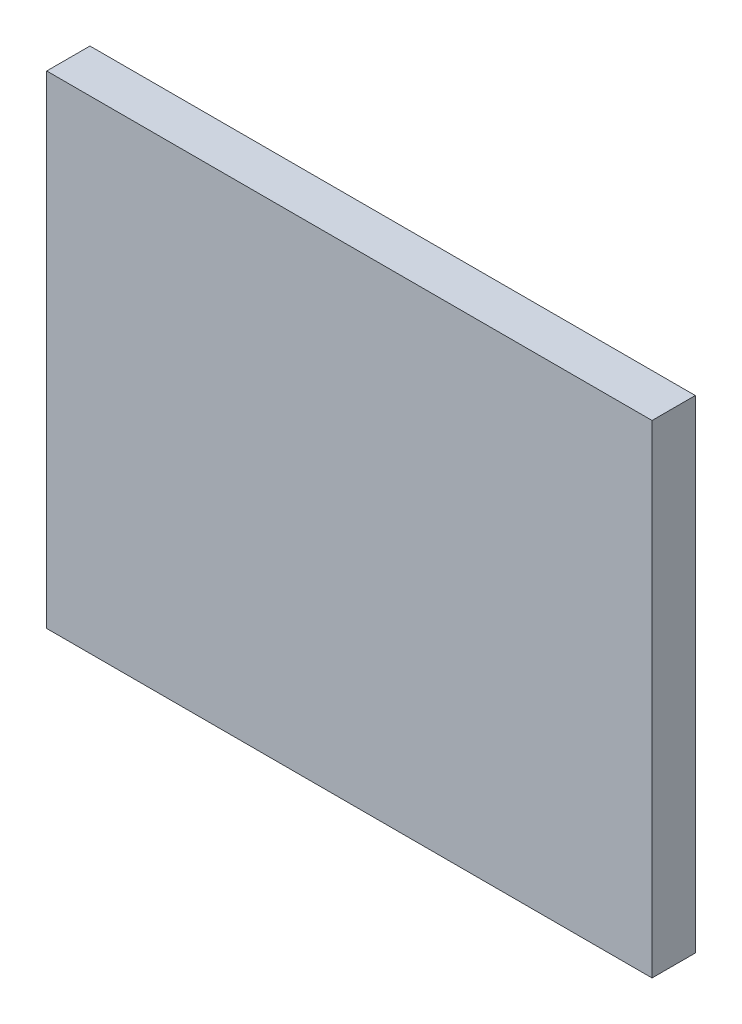
ISO-10303-21;
HEADER;
FILE_DESCRIPTION(('STEP AP214'),'2;1');
FILE_NAME('part.step','',(''),(''),'','','');
FILE_SCHEMA(('AUTOMOTIVE_DESIGN { 1 0 10303 214 1 1 1 1 }'));
ENDSEC;
DATA;
#1=APPLICATION_CONTEXT('core data for automotive mechanical design processes');
#2=APPLICATION_PROTOCOL_DEFINITION('international standard','automotive_design',2000,#1);
#3=PRODUCT_CONTEXT('',#1,'mechanical');
#4=PRODUCT('Part','Part','',(#3));
#5=PRODUCT_RELATED_PRODUCT_CATEGORY('part','',(#4));
#6=PRODUCT_DEFINITION_FORMATION('','',#4);
#7=PRODUCT_DEFINITION_CONTEXT('part definition',#1,'design');
#8=PRODUCT_DEFINITION('design','',#6,#7);
#9=PRODUCT_DEFINITION_SHAPE('','',#8);
#10=(LENGTH_UNIT() NAMED_UNIT(*) SI_UNIT(.MILLI.,.METRE.));
#11=(NAMED_UNIT(*) PLANE_ANGLE_UNIT() SI_UNIT($,.RADIAN.));
#12=(NAMED_UNIT(*) SI_UNIT($,.STERADIAN.) SOLID_ANGLE_UNIT());
#13=UNCERTAINTY_MEASURE_WITH_UNIT(LENGTH_MEASURE(1.E-05),#10,'distance_accuracy_value','');
#14=(GEOMETRIC_REPRESENTATION_CONTEXT(3) GLOBAL_UNCERTAINTY_ASSIGNED_CONTEXT((#13)) GLOBAL_UNIT_ASSIGNED_CONTEXT((#10,
#11,#12)) REPRESENTATION_CONTEXT('',''));
#15=CARTESIAN_POINT('',(0.,0.,0.));
#16=DIRECTION('',(0.,0.,1.));
#17=DIRECTION('',(1.,0.,0.));
#18=AXIS2_PLACEMENT_3D('',#15,#16,#17);
#19=CARTESIAN_POINT('',(21.,16.75,3.));
#20=DIRECTION('',(-1.,0.,0.));
#21=DIRECTION('',(0.,-1.,0.));
#22=AXIS2_PLACEMENT_3D('',#19,#20,#21);
#23=PLANE('',#22);
#24=DIRECTION('',(0.,1.,0.));
#25=VECTOR('',#24,1.);
#26=CARTESIAN_POINT('',(21.,16.75,0.));
#27=LINE('',#26,#25);
#28=CARTESIAN_POINT('',(21.,-16.75,0.));
#29=VERTEX_POINT('',#28);
#30=CARTESIAN_POINT('',(21.,16.75,0.));
#31=VERTEX_POINT('',#30);
#32=EDGE_CURVE('E109',#29,#31,#27,.T.);
#33=ORIENTED_EDGE('',*,*,#32,.T.);
#34=DIRECTION('',(0.,0.,-1.));
#35=VECTOR('',#34,1.);
#36=CARTESIAN_POINT('',(21.,16.75,3.));
#37=LINE('',#36,#35);
#38=CARTESIAN_POINT('',(21.,16.75,3.));
#39=VERTEX_POINT('',#38);
#40=EDGE_CURVE('E11',#39,#31,#37,.T.);
#41=ORIENTED_EDGE('',*,*,#40,.F.);
#42=DIRECTION('',(0.,1.,0.));
#43=VECTOR('',#42,1.);
#44=CARTESIAN_POINT('',(21.,16.75,3.));
#45=LINE('',#44,#43);
#46=CARTESIAN_POINT('',(21.,-16.75,3.));
#47=VERTEX_POINT('',#46);
#48=EDGE_CURVE('E93',#47,#39,#45,.T.);
#49=ORIENTED_EDGE('',*,*,#48,.F.);
#50=DIRECTION('',(0.,0.,-1.));
#51=VECTOR('',#50,1.);
#52=CARTESIAN_POINT('',(21.,-16.75,3.));
#53=LINE('',#52,#51);
#54=EDGE_CURVE('E105',#47,#29,#53,.T.);
#55=ORIENTED_EDGE('',*,*,#54,.T.);
#56=EDGE_LOOP('',(#33,#41,#49,#55));
#57=FACE_BOUND('',#56,.T.);
#58=ADVANCED_FACE('F41',(#57),#23,.F.);
#59=CARTESIAN_POINT('',(-21.,16.75,3.));
#60=DIRECTION('',(0.,-1.,0.));
#61=DIRECTION('',(0.,0.,-1.));
#62=AXIS2_PLACEMENT_3D('',#59,#60,#61);
#63=PLANE('',#62);
#64=DIRECTION('',(-1.,0.,0.));
#65=VECTOR('',#64,1.);
#66=CARTESIAN_POINT('',(-21.,16.75,0.));
#67=LINE('',#66,#65);
#68=CARTESIAN_POINT('',(-21.,16.75,0.));
#69=VERTEX_POINT('',#68);
#70=EDGE_CURVE('E98',#31,#69,#67,.T.);
#71=ORIENTED_EDGE('',*,*,#70,.T.);
#72=DIRECTION('',(0.,0.,-1.));
#73=VECTOR('',#72,1.);
#74=CARTESIAN_POINT('',(-21.,16.75,3.));
#75=LINE('',#74,#73);
#76=CARTESIAN_POINT('',(-21.,16.75,3.));
#77=VERTEX_POINT('',#76);
#78=EDGE_CURVE('E50',#77,#69,#75,.T.);
#79=ORIENTED_EDGE('',*,*,#78,.F.);
#80=DIRECTION('',(-1.,0.,0.));
#81=VECTOR('',#80,1.);
#82=CARTESIAN_POINT('',(-21.,16.75,3.));
#83=LINE('',#82,#81);
#84=EDGE_CURVE('E88',#39,#77,#83,.T.);
#85=ORIENTED_EDGE('',*,*,#84,.F.);
#86=ORIENTED_EDGE('',*,*,#40,.T.);
#87=EDGE_LOOP('',(#71,#79,#85,#86));
#88=FACE_BOUND('',#87,.T.);
#89=ADVANCED_FACE('F97',(#88),#63,.F.);
#90=CARTESIAN_POINT('',(-21.,16.75,3.));
#91=DIRECTION('',(1.,0.,0.));
#92=DIRECTION('',(0.,1.,0.));
#93=AXIS2_PLACEMENT_3D('',#90,#91,#92);
#94=PLANE('',#93);
#95=DIRECTION('',(0.,-1.,0.));
#96=VECTOR('',#95,1.);
#97=CARTESIAN_POINT('',(-21.,16.75,0.));
#98=LINE('',#97,#96);
#99=CARTESIAN_POINT('',(-21.,-16.75,0.));
#100=VERTEX_POINT('',#99);
#101=EDGE_CURVE('E75',#69,#100,#98,.T.);
#102=ORIENTED_EDGE('',*,*,#101,.T.);
#103=DIRECTION('',(0.,0.,-1.));
#104=VECTOR('',#103,1.);
#105=CARTESIAN_POINT('',(-21.,-16.75,3.));
#106=LINE('',#105,#104);
#107=CARTESIAN_POINT('',(-21.,-16.75,3.));
#108=VERTEX_POINT('',#107);
#109=EDGE_CURVE('E100',#108,#100,#106,.T.);
#110=ORIENTED_EDGE('',*,*,#109,.F.);
#111=DIRECTION('',(0.,-1.,0.));
#112=VECTOR('',#111,1.);
#113=CARTESIAN_POINT('',(-21.,16.75,3.));
#114=LINE('',#113,#112);
#115=EDGE_CURVE('E91',#77,#108,#114,.T.);
#116=ORIENTED_EDGE('',*,*,#115,.F.);
#117=ORIENTED_EDGE('',*,*,#78,.T.);
#118=EDGE_LOOP('',(#102,#110,#116,#117));
#119=FACE_BOUND('',#118,.T.);
#120=ADVANCED_FACE('F101',(#119),#94,.F.);
#121=CARTESIAN_POINT('',(-21.,-16.75,3.));
#122=DIRECTION('',(0.,1.,0.));
#123=DIRECTION('',(0.,0.,1.));
#124=AXIS2_PLACEMENT_3D('',#121,#122,#123);
#125=PLANE('',#124);
#126=DIRECTION('',(1.,0.,0.));
#127=VECTOR('',#126,1.);
#128=CARTESIAN_POINT('',(-21.,-16.75,0.));
#129=LINE('',#128,#127);
#130=EDGE_CURVE('E81',#100,#29,#129,.T.);
#131=ORIENTED_EDGE('',*,*,#130,.T.);
#132=ORIENTED_EDGE('',*,*,#54,.F.);
#133=DIRECTION('',(1.,0.,0.));
#134=VECTOR('',#133,1.);
#135=CARTESIAN_POINT('',(-21.,-16.75,3.));
#136=LINE('',#135,#134);
#137=EDGE_CURVE('E58',#108,#47,#136,.T.);
#138=ORIENTED_EDGE('',*,*,#137,.F.);
#139=ORIENTED_EDGE('',*,*,#109,.T.);
#140=EDGE_LOOP('',(#131,#132,#138,#139));
#141=FACE_BOUND('',#140,.T.);
#142=ADVANCED_FACE('F122',(#141),#125,.F.);
#143=CARTESIAN_POINT('',(0.,0.,3.));
#144=DIRECTION('',(0.,0.,1.));
#145=DIRECTION('',(1.,0.,0.));
#146=AXIS2_PLACEMENT_3D('',#143,#144,#145);
#147=PLANE('',#146);
#148=ORIENTED_EDGE('',*,*,#48,.T.);
#149=ORIENTED_EDGE('',*,*,#84,.T.);
#150=ORIENTED_EDGE('',*,*,#115,.T.);
#151=ORIENTED_EDGE('',*,*,#137,.T.);
#152=EDGE_LOOP('',(#148,#149,#150,#151));
#153=FACE_BOUND('',#152,.T.);
#154=ADVANCED_FACE('F89',(#153),#147,.T.);
#155=CARTESIAN_POINT('',(0.,0.,0.));
#156=DIRECTION('',(0.,0.,1.));
#157=DIRECTION('',(1.,0.,0.));
#158=AXIS2_PLACEMENT_3D('',#155,#156,#157);
#159=PLANE('',#158);
#160=ORIENTED_EDGE('',*,*,#32,.F.);
#161=ORIENTED_EDGE('',*,*,#130,.F.);
#162=ORIENTED_EDGE('',*,*,#101,.F.);
#163=ORIENTED_EDGE('',*,*,#70,.F.);
#164=EDGE_LOOP('',(#160,#161,#162,#163));
#165=FACE_BOUND('',#164,.T.);
#166=ADVANCED_FACE('F125',(#165),#159,.F.);
#167=CLOSED_SHELL('',(#58,#89,#120,#142,#154,#166));
#168=MANIFOLD_SOLID_BREP('B2',#167);
#169=ADVANCED_BREP_SHAPE_REPRESENTATION('',(#18,#168),#14);
#170=SHAPE_DEFINITION_REPRESENTATION(#9,#169);
ENDSEC;
END-ISO-10303-21;
